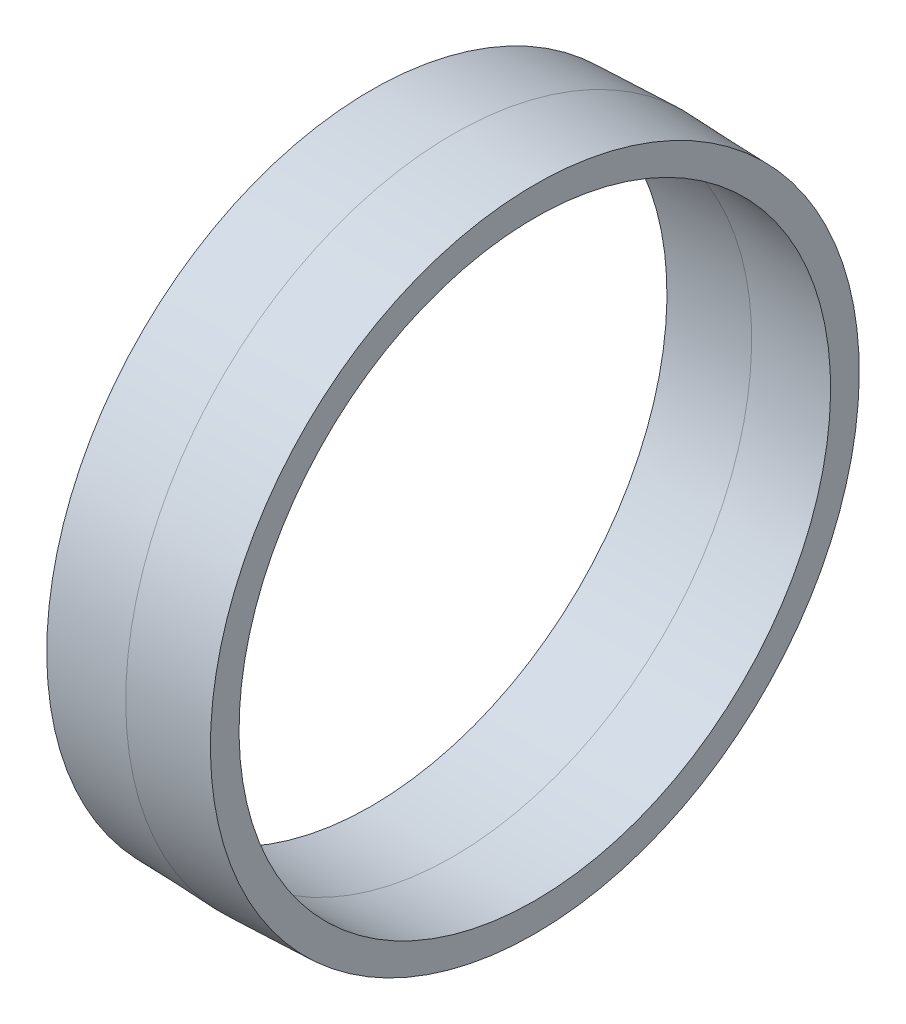
ISO-10303-21;
HEADER;
FILE_DESCRIPTION(('STEP AP214'),'2;1');
FILE_NAME('part.step','',(''),(''),'','','');
FILE_SCHEMA(('AUTOMOTIVE_DESIGN { 1 0 10303 214 1 1 1 1 }'));
ENDSEC;
DATA;
#1=APPLICATION_CONTEXT('core data for automotive mechanical design processes');
#2=APPLICATION_PROTOCOL_DEFINITION('international standard','automotive_design',2000,#1);
#3=PRODUCT_CONTEXT('',#1,'mechanical');
#4=PRODUCT('Part','Part','',(#3));
#5=PRODUCT_RELATED_PRODUCT_CATEGORY('part','',(#4));
#6=PRODUCT_DEFINITION_FORMATION('','',#4);
#7=PRODUCT_DEFINITION_CONTEXT('part definition',#1,'design');
#8=PRODUCT_DEFINITION('design','',#6,#7);
#9=PRODUCT_DEFINITION_SHAPE('','',#8);
#10=(LENGTH_UNIT() NAMED_UNIT(*) SI_UNIT(.MILLI.,.METRE.));
#11=(NAMED_UNIT(*) PLANE_ANGLE_UNIT() SI_UNIT($,.RADIAN.));
#12=(NAMED_UNIT(*) SI_UNIT($,.STERADIAN.) SOLID_ANGLE_UNIT());
#13=UNCERTAINTY_MEASURE_WITH_UNIT(LENGTH_MEASURE(1.E-05),#10,'distance_accuracy_value','');
#14=(GEOMETRIC_REPRESENTATION_CONTEXT(3) GLOBAL_UNCERTAINTY_ASSIGNED_CONTEXT((#13)) GLOBAL_UNIT_ASSIGNED_CONTEXT((#10,
#11,#12)) REPRESENTATION_CONTEXT('',''));
#15=CARTESIAN_POINT('',(0.,0.,0.));
#16=DIRECTION('',(0.,0.,1.));
#17=DIRECTION('',(1.,0.,0.));
#18=AXIS2_PLACEMENT_3D('',#15,#16,#17);
#19=CARTESIAN_POINT('',(11.4759337539432,50.3565062274549,0.));
#20=DIRECTION('',(-1.,0.,0.));
#21=DIRECTION('',(0.,1.,0.));
#22=AXIS2_PLACEMENT_3D('',#19,#20,#21);
#23=PLANE('',#22);
#24=CARTESIAN_POINT('',(11.4759337539432,0.,0.));
#25=DIRECTION('',(-1.,0.,0.));
#26=DIRECTION('',(0.,-1.,0.));
#27=AXIS2_PLACEMENT_3D('',#24,#25,#26);
#28=CIRCLE('',#27,45.9115062274549);
#29=CARTESIAN_POINT('',(11.4759337539432,-45.9115062274549,0.));
#30=VERTEX_POINT('',#29);
#31=EDGE_CURVE('E39',#30,#30,#28,.T.);
#32=ORIENTED_EDGE('',*,*,#31,.T.);
#33=EDGE_LOOP('',(#32));
#34=FACE_BOUND('',#33,.T.);
#35=CARTESIAN_POINT('',(11.4759337539432,0.,0.));
#36=DIRECTION('',(-1.,0.,0.));
#37=DIRECTION('',(0.,-1.,0.));
#38=AXIS2_PLACEMENT_3D('',#35,#36,#37);
#39=CIRCLE('',#38,50.3565062274549);
#40=CARTESIAN_POINT('',(11.4759337539432,-50.3565062274549,0.));
#41=VERTEX_POINT('',#40);
#42=EDGE_CURVE('E32',#41,#41,#39,.T.);
#43=ORIENTED_EDGE('',*,*,#42,.F.);
#44=EDGE_LOOP('',(#43));
#45=FACE_BOUND('',#44,.T.);
#46=ADVANCED_FACE('F15',(#34,#45),#23,.F.);
#47=CARTESIAN_POINT('',(-13.9240662460568,45.9115062274549,0.));
#48=DIRECTION('',(1.,0.,0.));
#49=DIRECTION('',(0.,1.,0.));
#50=AXIS2_PLACEMENT_3D('',#47,#48,#49);
#51=PLANE('',#50);
#52=CARTESIAN_POINT('',(-13.9240662460568,0.,0.));
#53=DIRECTION('',(-1.,0.,0.));
#54=DIRECTION('',(0.,-1.,0.));
#55=AXIS2_PLACEMENT_3D('',#52,#53,#54);
#56=CIRCLE('',#55,45.9115062274549);
#57=CARTESIAN_POINT('',(-13.9240662460568,-45.9115062274549,0.));
#58=VERTEX_POINT('',#57);
#59=EDGE_CURVE('E48',#58,#58,#56,.T.);
#60=ORIENTED_EDGE('',*,*,#59,.F.);
#61=EDGE_LOOP('',(#60));
#62=FACE_BOUND('',#61,.T.);
#63=CARTESIAN_POINT('',(-13.9240662460568,0.,0.));
#64=DIRECTION('',(-1.,0.,0.));
#65=DIRECTION('',(0.,-1.,0.));
#66=AXIS2_PLACEMENT_3D('',#63,#64,#65);
#67=CIRCLE('',#66,50.3565062274549);
#68=CARTESIAN_POINT('',(-13.9240662460568,-50.3565062274549,0.));
#69=VERTEX_POINT('',#68);
#70=EDGE_CURVE('E10',#69,#69,#67,.T.);
#71=ORIENTED_EDGE('',*,*,#70,.T.);
#72=EDGE_LOOP('',(#71));
#73=FACE_BOUND('',#72,.T.);
#74=ADVANCED_FACE('F61',(#62,#73),#51,.F.);
#75=CARTESIAN_POINT('',(-1.22406624605676,0.,0.));
#76=DIRECTION('',(1.,0.,0.));
#77=DIRECTION('',(0.,1.,0.));
#78=AXIS2_PLACEMENT_3D('',#75,#76,#77);
#79=CONICAL_SURFACE('',#78,50.8,0.0349065850398793);
#80=CARTESIAN_POINT('',(-1.22406624605676,0.,0.));
#81=DIRECTION('',(-1.,0.,0.));
#82=DIRECTION('',(0.,-1.,0.));
#83=AXIS2_PLACEMENT_3D('',#80,#81,#82);
#84=CIRCLE('',#83,50.8);
#85=CARTESIAN_POINT('',(-1.22406624605676,-50.8,0.));
#86=VERTEX_POINT('',#85);
#87=EDGE_CURVE('E18',#86,#86,#84,.T.);
#88=ORIENTED_EDGE('',*,*,#87,.T.);
#89=EDGE_LOOP('',(#88));
#90=FACE_BOUND('',#89,.T.);
#91=ORIENTED_EDGE('',*,*,#70,.F.);
#92=EDGE_LOOP('',(#91));
#93=FACE_BOUND('',#92,.T.);
#94=ADVANCED_FACE('F64',(#90,#93),#79,.T.);
#95=CARTESIAN_POINT('',(11.4759337539432,0.,0.));
#96=DIRECTION('',(-1.,0.,0.));
#97=DIRECTION('',(0.,-1.,0.));
#98=AXIS2_PLACEMENT_3D('',#95,#96,#97);
#99=CONICAL_SURFACE('',#98,50.3565062274549,0.0349065850398793);
#100=ORIENTED_EDGE('',*,*,#87,.F.);
#101=EDGE_LOOP('',(#100));
#102=FACE_BOUND('',#101,.T.);
#103=ORIENTED_EDGE('',*,*,#42,.T.);
#104=EDGE_LOOP('',(#103));
#105=FACE_BOUND('',#104,.T.);
#106=ADVANCED_FACE('F67',(#102,#105),#99,.T.);
#107=CARTESIAN_POINT('',(-1.22406624605676,0.,0.));
#108=DIRECTION('',(-1.,0.,0.));
#109=DIRECTION('',(0.,-1.,0.));
#110=AXIS2_PLACEMENT_3D('',#107,#108,#109);
#111=CONICAL_SURFACE('',#110,46.355,0.0349065850398793);
#112=CARTESIAN_POINT('',(-1.22406624605676,0.,0.));
#113=DIRECTION('',(-1.,0.,0.));
#114=DIRECTION('',(0.,-1.,0.));
#115=AXIS2_PLACEMENT_3D('',#112,#113,#114);
#116=CIRCLE('',#115,46.355);
#117=CARTESIAN_POINT('',(-1.22406624605676,-46.355,0.));
#118=VERTEX_POINT('',#117);
#119=EDGE_CURVE('E34',#118,#118,#116,.T.);
#120=ORIENTED_EDGE('',*,*,#119,.T.);
#121=EDGE_LOOP('',(#120));
#122=FACE_BOUND('',#121,.T.);
#123=ORIENTED_EDGE('',*,*,#31,.F.);
#124=EDGE_LOOP('',(#123));
#125=FACE_BOUND('',#124,.T.);
#126=ADVANCED_FACE('F74',(#122,#125),#111,.F.);
#127=CARTESIAN_POINT('',(-13.9240662460568,0.,0.));
#128=DIRECTION('',(1.,0.,0.));
#129=DIRECTION('',(0.,1.,0.));
#130=AXIS2_PLACEMENT_3D('',#127,#128,#129);
#131=CONICAL_SURFACE('',#130,45.9115062274549,0.0349065850398793);
#132=ORIENTED_EDGE('',*,*,#119,.F.);
#133=EDGE_LOOP('',(#132));
#134=FACE_BOUND('',#133,.T.);
#135=ORIENTED_EDGE('',*,*,#59,.T.);
#136=EDGE_LOOP('',(#135));
#137=FACE_BOUND('',#136,.T.);
#138=ADVANCED_FACE('F56',(#134,#137),#131,.F.);
#139=CLOSED_SHELL('',(#46,#74,#94,#106,#126,#138));
#140=MANIFOLD_SOLID_BREP('B1',#139);
#141=ADVANCED_BREP_SHAPE_REPRESENTATION('',(#18,#140),#14);
#142=SHAPE_DEFINITION_REPRESENTATION(#9,#141);
ENDSEC;
END-ISO-10303-21;
